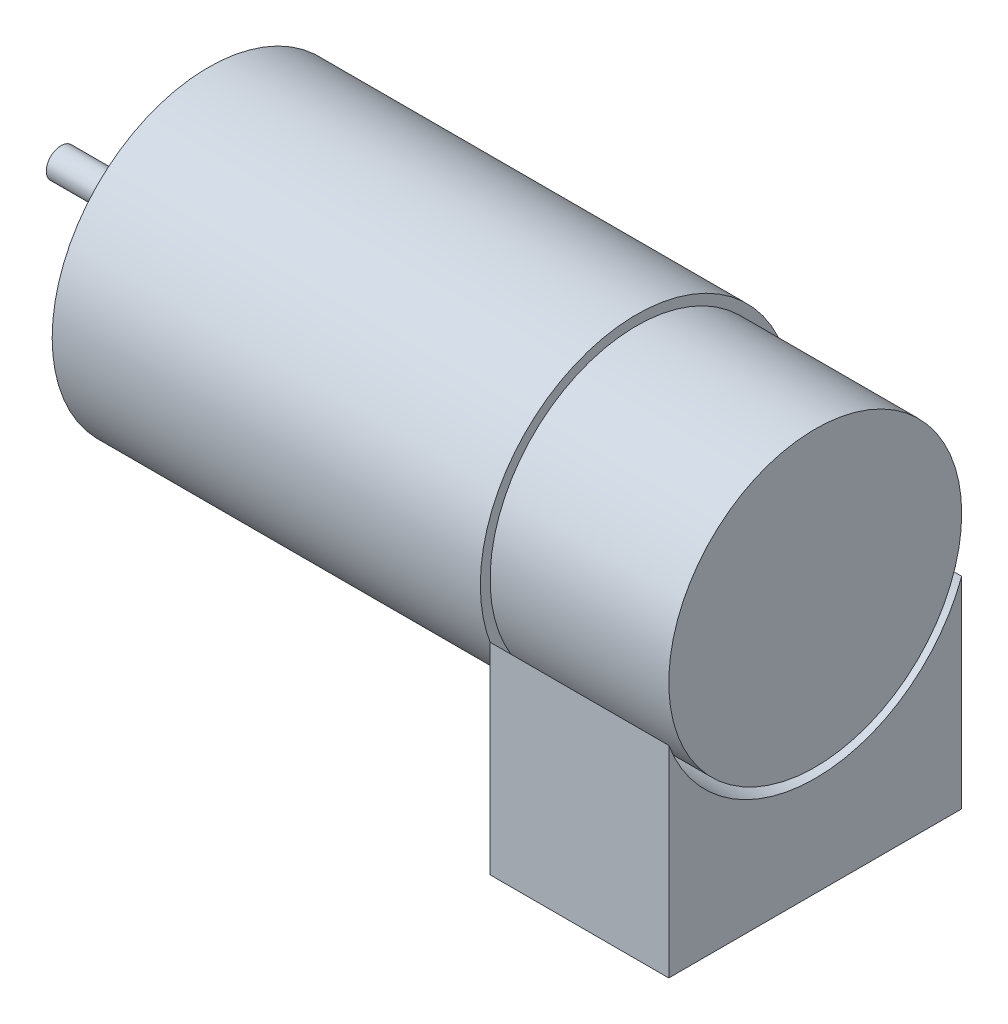
ISO-10303-21;
HEADER;
FILE_DESCRIPTION(('STEP AP214'),'2;1');
FILE_NAME('part.step','',(''),(''),'','','');
FILE_SCHEMA(('AUTOMOTIVE_DESIGN { 1 0 10303 214 1 1 1 1 }'));
ENDSEC;
DATA;
#1=APPLICATION_CONTEXT('core data for automotive mechanical design processes');
#2=APPLICATION_PROTOCOL_DEFINITION('international standard','automotive_design',2000,#1);
#3=PRODUCT_CONTEXT('',#1,'mechanical');
#4=PRODUCT('Part','Part','',(#3));
#5=PRODUCT_RELATED_PRODUCT_CATEGORY('part','',(#4));
#6=PRODUCT_DEFINITION_FORMATION('','',#4);
#7=PRODUCT_DEFINITION_CONTEXT('part definition',#1,'design');
#8=PRODUCT_DEFINITION('design','',#6,#7);
#9=PRODUCT_DEFINITION_SHAPE('','',#8);
#10=(LENGTH_UNIT() NAMED_UNIT(*) SI_UNIT(.MILLI.,.METRE.));
#11=(NAMED_UNIT(*) PLANE_ANGLE_UNIT() SI_UNIT($,.RADIAN.));
#12=(NAMED_UNIT(*) SI_UNIT($,.STERADIAN.) SOLID_ANGLE_UNIT());
#13=UNCERTAINTY_MEASURE_WITH_UNIT(LENGTH_MEASURE(1.E-05),#10,'distance_accuracy_value','');
#14=(GEOMETRIC_REPRESENTATION_CONTEXT(3) GLOBAL_UNCERTAINTY_ASSIGNED_CONTEXT((#13)) GLOBAL_UNIT_ASSIGNED_CONTEXT((#10,
#11,#12)) REPRESENTATION_CONTEXT('',''));
#15=CARTESIAN_POINT('',(0.,0.,0.));
#16=DIRECTION('',(0.,0.,1.));
#17=DIRECTION('',(1.,0.,0.));
#18=AXIS2_PLACEMENT_3D('',#15,#16,#17);
#19=CARTESIAN_POINT('',(77.25,-26.2,0.));
#20=DIRECTION('',(0.,1.,0.));
#21=DIRECTION('',(0.,0.,1.));
#22=AXIS2_PLACEMENT_3D('',#19,#20,#21);
#23=PLANE('',#22);
#24=DIRECTION('',(0.,0.,-1.));
#25=VECTOR('',#24,1.);
#26=CARTESIAN_POINT('',(58.95,-26.2,0.));
#27=LINE('',#26,#25);
#28=CARTESIAN_POINT('',(58.95,-26.2,15.));
#29=VERTEX_POINT('',#28);
#30=CARTESIAN_POINT('',(58.95,-26.2,-15.));
#31=VERTEX_POINT('',#30);
#32=EDGE_CURVE('E122',#29,#31,#27,.T.);
#33=ORIENTED_EDGE('',*,*,#32,.T.);
#34=DIRECTION('',(-1.,0.,0.));
#35=VECTOR('',#34,1.);
#36=CARTESIAN_POINT('',(77.25,-26.2,-15.));
#37=LINE('',#36,#35);
#38=CARTESIAN_POINT('',(77.25,-26.2,-15.));
#39=VERTEX_POINT('',#38);
#40=EDGE_CURVE('E13',#39,#31,#37,.T.);
#41=ORIENTED_EDGE('',*,*,#40,.F.);
#42=DIRECTION('',(0.,0.,-1.));
#43=VECTOR('',#42,1.);
#44=CARTESIAN_POINT('',(77.25,-26.2,0.));
#45=LINE('',#44,#43);
#46=CARTESIAN_POINT('',(77.25,-26.2,15.));
#47=VERTEX_POINT('',#46);
#48=EDGE_CURVE('E107',#47,#39,#45,.T.);
#49=ORIENTED_EDGE('',*,*,#48,.F.);
#50=DIRECTION('',(-1.,0.,0.));
#51=VECTOR('',#50,1.);
#52=CARTESIAN_POINT('',(77.25,-26.2,15.));
#53=LINE('',#52,#51);
#54=EDGE_CURVE('E118',#47,#29,#53,.T.);
#55=ORIENTED_EDGE('',*,*,#54,.T.);
#56=EDGE_LOOP('',(#33,#41,#49,#55));
#57=FACE_BOUND('',#56,.T.);
#58=ADVANCED_FACE('F60',(#57),#23,.F.);
#59=CARTESIAN_POINT('',(77.25,0.,-15.));
#60=DIRECTION('',(0.,0.,1.));
#61=DIRECTION('',(0.,-1.,0.));
#62=AXIS2_PLACEMENT_3D('',#59,#60,#61);
#63=PLANE('',#62);
#64=DIRECTION('',(0.,1.,0.));
#65=VECTOR('',#64,1.);
#66=CARTESIAN_POINT('',(58.95,0.,-15.));
#67=LINE('',#66,#65);
#68=CARTESIAN_POINT('',(58.95,-5.56776436283002,-15.));
#69=VERTEX_POINT('',#68);
#70=EDGE_CURVE('E112',#31,#69,#67,.T.);
#71=ORIENTED_EDGE('',*,*,#70,.T.);
#72=DIRECTION('',(-1.,0.,0.));
#73=VECTOR('',#72,1.);
#74=CARTESIAN_POINT('',(77.25,-5.56776436283002,-15.));
#75=LINE('',#74,#73);
#76=CARTESIAN_POINT('',(77.25,-5.56776436283002,-15.));
#77=VERTEX_POINT('',#76);
#78=EDGE_CURVE('E68',#77,#69,#75,.T.);
#79=ORIENTED_EDGE('',*,*,#78,.F.);
#80=DIRECTION('',(0.,1.,0.));
#81=VECTOR('',#80,1.);
#82=CARTESIAN_POINT('',(77.25,0.,-15.));
#83=LINE('',#82,#81);
#84=EDGE_CURVE('E102',#39,#77,#83,.T.);
#85=ORIENTED_EDGE('',*,*,#84,.F.);
#86=ORIENTED_EDGE('',*,*,#40,.T.);
#87=EDGE_LOOP('',(#71,#79,#85,#86));
#88=FACE_BOUND('',#87,.T.);
#89=ADVANCED_FACE('F111',(#88),#63,.F.);
#90=CARTESIAN_POINT('',(77.25,0.,0.));
#91=DIRECTION('',(-1.,0.,0.));
#92=DIRECTION('',(0.,0.,1.));
#93=AXIS2_PLACEMENT_3D('',#90,#91,#92);
#94=CYLINDRICAL_SURFACE('',#93,16.);
#95=CARTESIAN_POINT('',(58.95,0.,0.));
#96=DIRECTION('',(1.,0.,0.));
#97=DIRECTION('',(0.,0.,-1.));
#98=AXIS2_PLACEMENT_3D('',#95,#96,#97);
#99=CIRCLE('',#98,16.);
#100=CARTESIAN_POINT('',(58.95,-5.56776436283002,15.));
#101=VERTEX_POINT('',#100);
#102=EDGE_CURVE('E126',#101,#69,#99,.T.);
#103=ORIENTED_EDGE('',*,*,#102,.F.);
#104=DIRECTION('',(-1.,0.,0.));
#105=VECTOR('',#104,1.);
#106=CARTESIAN_POINT('',(77.25,-5.56776436283002,15.));
#107=LINE('',#106,#105);
#108=CARTESIAN_POINT('',(77.25,-5.56776436283002,15.));
#109=VERTEX_POINT('',#108);
#110=EDGE_CURVE('E92',#109,#101,#107,.T.);
#111=ORIENTED_EDGE('',*,*,#110,.F.);
#112=CARTESIAN_POINT('',(77.25,0.,0.));
#113=DIRECTION('',(1.,0.,0.));
#114=DIRECTION('',(0.,0.,-1.));
#115=AXIS2_PLACEMENT_3D('',#112,#113,#114);
#116=CIRCLE('',#115,16.);
#117=EDGE_CURVE('E105',#109,#77,#116,.T.);
#118=ORIENTED_EDGE('',*,*,#117,.T.);
#119=ORIENTED_EDGE('',*,*,#78,.T.);
#120=EDGE_LOOP('',(#103,#111,#118,#119));
#121=FACE_BOUND('',#120,.T.);
#122=ADVANCED_FACE('F116',(#121),#94,.F.);
#123=CARTESIAN_POINT('',(77.25,0.,15.));
#124=DIRECTION('',(0.,0.,-1.));
#125=DIRECTION('',(0.,1.,0.));
#126=AXIS2_PLACEMENT_3D('',#123,#124,#125);
#127=PLANE('',#126);
#128=DIRECTION('',(0.,-1.,0.));
#129=VECTOR('',#128,1.);
#130=CARTESIAN_POINT('',(58.95,0.,15.));
#131=LINE('',#130,#129);
#132=EDGE_CURVE('E95',#101,#29,#131,.T.);
#133=ORIENTED_EDGE('',*,*,#132,.T.);
#134=ORIENTED_EDGE('',*,*,#54,.F.);
#135=DIRECTION('',(0.,-1.,0.));
#136=VECTOR('',#135,1.);
#137=CARTESIAN_POINT('',(77.25,0.,15.));
#138=LINE('',#137,#136);
#139=EDGE_CURVE('E76',#109,#47,#138,.T.);
#140=ORIENTED_EDGE('',*,*,#139,.F.);
#141=ORIENTED_EDGE('',*,*,#110,.T.);
#142=EDGE_LOOP('',(#133,#134,#140,#141));
#143=FACE_BOUND('',#142,.T.);
#144=ADVANCED_FACE('F139',(#143),#127,.F.);
#145=CARTESIAN_POINT('',(77.25,0.,0.));
#146=DIRECTION('',(1.,0.,0.));
#147=DIRECTION('',(0.,0.,-1.));
#148=AXIS2_PLACEMENT_3D('',#145,#146,#147);
#149=PLANE('',#148);
#150=ORIENTED_EDGE('',*,*,#48,.T.);
#151=ORIENTED_EDGE('',*,*,#84,.T.);
#152=ORIENTED_EDGE('',*,*,#117,.F.);
#153=ORIENTED_EDGE('',*,*,#139,.T.);
#154=EDGE_LOOP('',(#150,#151,#152,#153));
#155=FACE_BOUND('',#154,.T.);
#156=ADVANCED_FACE('F103',(#155),#149,.T.);
#157=CARTESIAN_POINT('',(58.95,0.,0.));
#158=DIRECTION('',(1.,0.,0.));
#159=DIRECTION('',(0.,0.,-1.));
#160=AXIS2_PLACEMENT_3D('',#157,#158,#159);
#161=PLANE('',#160);
#162=ORIENTED_EDGE('',*,*,#32,.F.);
#163=ORIENTED_EDGE('',*,*,#132,.F.);
#164=ORIENTED_EDGE('',*,*,#102,.T.);
#165=ORIENTED_EDGE('',*,*,#70,.F.);
#166=EDGE_LOOP('',(#162,#163,#164,#165));
#167=FACE_BOUND('',#166,.T.);
#168=ADVANCED_FACE('F133',(#167),#161,.F.);
#169=CLOSED_SHELL('',(#58,#89,#122,#144,#156,#168));
#170=MANIFOLD_SOLID_BREP('B2',#169);
#171=CARTESIAN_POINT('',(0.,0.,0.));
#172=DIRECTION('',(-1.,0.,0.));
#173=DIRECTION('',(0.,0.,1.));
#174=AXIS2_PLACEMENT_3D('',#171,#172,#173);
#175=PLANE('',#174);
#176=CARTESIAN_POINT('',(0.,0.,0.));
#177=DIRECTION('',(-1.,0.,0.));
#178=DIRECTION('',(0.,0.,1.));
#179=AXIS2_PLACEMENT_3D('',#176,#177,#178);
#180=CIRCLE('',#179,1.5);
#181=CARTESIAN_POINT('',(0.,0.,1.5));
#182=VERTEX_POINT('',#181);
#183=EDGE_CURVE('E240',#182,#182,#180,.T.);
#184=ORIENTED_EDGE('',*,*,#183,.T.);
#185=EDGE_LOOP('',(#184));
#186=FACE_BOUND('',#185,.T.);
#187=ADVANCED_FACE('F184',(#186),#175,.T.);
#188=CARTESIAN_POINT('',(58.95,0.,0.));
#189=DIRECTION('',(1.,0.,0.));
#190=DIRECTION('',(0.,0.,-1.));
#191=AXIS2_PLACEMENT_3D('',#188,#189,#190);
#192=PLANE('',#191);
#193=CARTESIAN_POINT('',(58.95,0.,0.));
#194=DIRECTION('',(1.,0.,0.));
#195=DIRECTION('',(0.,0.,-1.));
#196=AXIS2_PLACEMENT_3D('',#193,#194,#195);
#197=CIRCLE('',#196,15.);
#198=CARTESIAN_POINT('',(58.95,0.,-15.));
#199=VERTEX_POINT('',#198);
#200=EDGE_CURVE('E58',#199,#199,#197,.T.);
#201=ORIENTED_EDGE('',*,*,#200,.F.);
#202=EDGE_LOOP('',(#201));
#203=FACE_BOUND('',#202,.T.);
#204=CARTESIAN_POINT('',(58.95,0.,0.));
#205=DIRECTION('',(-1.,0.,0.));
#206=DIRECTION('',(0.,0.,1.));
#207=AXIS2_PLACEMENT_3D('',#204,#205,#206);
#208=CIRCLE('',#207,16.);
#209=CARTESIAN_POINT('',(58.95,0.,16.));
#210=VERTEX_POINT('',#209);
#211=EDGE_CURVE('E187',#210,#210,#208,.T.);
#212=ORIENTED_EDGE('',*,*,#211,.F.);
#213=EDGE_LOOP('',(#212));
#214=FACE_BOUND('',#213,.T.);
#215=ADVANCED_FACE('F262',(#203,#214),#192,.T.);
#216=CARTESIAN_POINT('',(0.,0.,0.));
#217=DIRECTION('',(-1.,0.,0.));
#218=DIRECTION('',(0.,0.,1.));
#219=AXIS2_PLACEMENT_3D('',#216,#217,#218);
#220=CYLINDRICAL_SURFACE('',#219,16.);
#221=ORIENTED_EDGE('',*,*,#211,.T.);
#222=EDGE_LOOP('',(#221));
#223=FACE_BOUND('',#222,.T.);
#224=CARTESIAN_POINT('',(15.1,0.,0.));
#225=DIRECTION('',(-1.,0.,0.));
#226=DIRECTION('',(0.,0.,1.));
#227=AXIS2_PLACEMENT_3D('',#224,#225,#226);
#228=CIRCLE('',#227,16.);
#229=CARTESIAN_POINT('',(15.1,0.,16.));
#230=VERTEX_POINT('',#229);
#231=EDGE_CURVE('E252',#230,#230,#228,.T.);
#232=ORIENTED_EDGE('',*,*,#231,.F.);
#233=EDGE_LOOP('',(#232));
#234=FACE_BOUND('',#233,.T.);
#235=ADVANCED_FACE('F259',(#223,#234),#220,.T.);
#236=CARTESIAN_POINT('',(15.1,0.,0.));
#237=DIRECTION('',(1.,0.,0.));
#238=DIRECTION('',(0.,0.,-1.));
#239=AXIS2_PLACEMENT_3D('',#236,#237,#238);
#240=PLANE('',#239);
#241=CARTESIAN_POINT('',(15.1,8.5,0.));
#242=DIRECTION('',(-1.,0.,0.));
#243=DIRECTION('',(0.,0.,1.));
#244=AXIS2_PLACEMENT_3D('',#241,#242,#243);
#245=CIRCLE('',#244,0.79999999999999);
#246=CARTESIAN_POINT('',(15.1,8.5,0.79999999999999));
#247=VERTEX_POINT('',#246);
#248=EDGE_CURVE('E216',#247,#247,#245,.T.);
#249=ORIENTED_EDGE('',*,*,#248,.F.);
#250=EDGE_LOOP('',(#249));
#251=FACE_BOUND('',#250,.T.);
#252=CARTESIAN_POINT('',(15.1,-4.28717923156454,-7.33962493840399));
#253=DIRECTION('',(-1.,0.,0.));
#254=DIRECTION('',(0.,0.,1.));
#255=AXIS2_PLACEMENT_3D('',#252,#253,#254);
#256=CIRCLE('',#255,0.79999999999999);
#257=CARTESIAN_POINT('',(15.1,-4.28717923156454,-6.539624938404));
#258=VERTEX_POINT('',#257);
#259=EDGE_CURVE('E215',#258,#258,#256,.T.);
#260=ORIENTED_EDGE('',*,*,#259,.F.);
#261=EDGE_LOOP('',(#260));
#262=FACE_BOUND('',#261,.T.);
#263=CARTESIAN_POINT('',(15.1,-4.25000000000003,7.36121593216771));
#264=DIRECTION('',(-1.,0.,0.));
#265=DIRECTION('',(0.,0.,1.));
#266=AXIS2_PLACEMENT_3D('',#263,#264,#265);
#267=CIRCLE('',#266,0.79999999999999);
#268=CARTESIAN_POINT('',(15.1,-4.25000000000003,8.1612159321677));
#269=VERTEX_POINT('',#268);
#270=EDGE_CURVE('E226',#269,#269,#267,.T.);
#271=ORIENTED_EDGE('',*,*,#270,.F.);
#272=EDGE_LOOP('',(#271));
#273=FACE_BOUND('',#272,.T.);
#274=CARTESIAN_POINT('',(15.1,-8.49982441863378,0.0546338026956659));
#275=DIRECTION('',(-1.,0.,0.));
#276=DIRECTION('',(0.,0.,1.));
#277=AXIS2_PLACEMENT_3D('',#274,#275,#276);
#278=CIRCLE('',#277,0.79999999999999);
#279=CARTESIAN_POINT('',(15.1,-8.49982441863378,0.854633802695656));
#280=VERTEX_POINT('',#279);
#281=EDGE_CURVE('E232',#280,#280,#278,.T.);
#282=ORIENTED_EDGE('',*,*,#281,.F.);
#283=EDGE_LOOP('',(#282));
#284=FACE_BOUND('',#283,.T.);
#285=CARTESIAN_POINT('',(15.1,0.,0.));
#286=DIRECTION('',(-1.,0.,0.));
#287=DIRECTION('',(0.,0.,1.));
#288=AXIS2_PLACEMENT_3D('',#285,#286,#287);
#289=CIRCLE('',#288,5.);
#290=CARTESIAN_POINT('',(15.1,0.,5.));
#291=VERTEX_POINT('',#290);
#292=EDGE_CURVE('E250',#291,#291,#289,.T.);
#293=ORIENTED_EDGE('',*,*,#292,.F.);
#294=EDGE_LOOP('',(#293));
#295=FACE_BOUND('',#294,.T.);
#296=ORIENTED_EDGE('',*,*,#231,.T.);
#297=EDGE_LOOP('',(#296));
#298=FACE_BOUND('',#297,.T.);
#299=ADVANCED_FACE('F269',(#251,#262,#273,#284,#295,#298),#240,.F.);
#300=CARTESIAN_POINT('',(0.,0.,0.));
#301=DIRECTION('',(-1.,0.,0.));
#302=DIRECTION('',(0.,0.,1.));
#303=AXIS2_PLACEMENT_3D('',#300,#301,#302);
#304=CYLINDRICAL_SURFACE('',#303,5.);
#305=ORIENTED_EDGE('',*,*,#292,.T.);
#306=EDGE_LOOP('',(#305));
#307=FACE_BOUND('',#306,.T.);
#308=CARTESIAN_POINT('',(13.,0.,0.));
#309=DIRECTION('',(-1.,0.,0.));
#310=DIRECTION('',(0.,0.,1.));
#311=AXIS2_PLACEMENT_3D('',#308,#309,#310);
#312=CIRCLE('',#311,5.);
#313=CARTESIAN_POINT('',(13.,0.,5.));
#314=VERTEX_POINT('',#313);
#315=EDGE_CURVE('E247',#314,#314,#312,.T.);
#316=ORIENTED_EDGE('',*,*,#315,.F.);
#317=EDGE_LOOP('',(#316));
#318=FACE_BOUND('',#317,.T.);
#319=ADVANCED_FACE('F276',(#307,#318),#304,.T.);
#320=CARTESIAN_POINT('',(13.,0.,0.));
#321=DIRECTION('',(1.,0.,0.));
#322=DIRECTION('',(0.,0.,-1.));
#323=AXIS2_PLACEMENT_3D('',#320,#321,#322);
#324=PLANE('',#323);
#325=CARTESIAN_POINT('',(13.,0.,0.));
#326=DIRECTION('',(-1.,0.,0.));
#327=DIRECTION('',(0.,0.,1.));
#328=AXIS2_PLACEMENT_3D('',#325,#326,#327);
#329=CIRCLE('',#328,1.5);
#330=CARTESIAN_POINT('',(13.,0.,1.5));
#331=VERTEX_POINT('',#330);
#332=EDGE_CURVE('E244',#331,#331,#329,.T.);
#333=ORIENTED_EDGE('',*,*,#332,.F.);
#334=EDGE_LOOP('',(#333));
#335=FACE_BOUND('',#334,.T.);
#336=ORIENTED_EDGE('',*,*,#315,.T.);
#337=EDGE_LOOP('',(#336));
#338=FACE_BOUND('',#337,.T.);
#339=ADVANCED_FACE('F280',(#335,#338),#324,.F.);
#340=CARTESIAN_POINT('',(0.,0.,0.));
#341=DIRECTION('',(-1.,0.,0.));
#342=DIRECTION('',(0.,0.,1.));
#343=AXIS2_PLACEMENT_3D('',#340,#341,#342);
#344=CYLINDRICAL_SURFACE('',#343,1.5);
#345=ORIENTED_EDGE('',*,*,#332,.T.);
#346=EDGE_LOOP('',(#345));
#347=FACE_BOUND('',#346,.T.);
#348=ORIENTED_EDGE('',*,*,#183,.F.);
#349=EDGE_LOOP('',(#348));
#350=FACE_BOUND('',#349,.T.);
#351=ADVANCED_FACE('F284',(#347,#350),#344,.T.);
#352=CARTESIAN_POINT('',(77.25,0.,0.));
#353=DIRECTION('',(-1.,0.,0.));
#354=DIRECTION('',(0.,0.,1.));
#355=AXIS2_PLACEMENT_3D('',#352,#353,#354);
#356=CYLINDRICAL_SURFACE('',#355,15.);
#357=CARTESIAN_POINT('',(77.25,0.,0.));
#358=DIRECTION('',(1.,0.,0.));
#359=DIRECTION('',(0.,0.,-1.));
#360=AXIS2_PLACEMENT_3D('',#357,#358,#359);
#361=CIRCLE('',#360,15.);
#362=CARTESIAN_POINT('',(77.25,0.,-15.));
#363=VERTEX_POINT('',#362);
#364=EDGE_CURVE('E238',#363,#363,#361,.T.);
#365=ORIENTED_EDGE('',*,*,#364,.F.);
#366=EDGE_LOOP('',(#365));
#367=FACE_BOUND('',#366,.T.);
#368=ORIENTED_EDGE('',*,*,#200,.T.);
#369=EDGE_LOOP('',(#368));
#370=FACE_BOUND('',#369,.T.);
#371=ADVANCED_FACE('F288',(#367,#370),#356,.T.);
#372=CARTESIAN_POINT('',(77.25,0.,0.));
#373=DIRECTION('',(1.,0.,0.));
#374=DIRECTION('',(0.,0.,-1.));
#375=AXIS2_PLACEMENT_3D('',#372,#373,#374);
#376=PLANE('',#375);
#377=ORIENTED_EDGE('',*,*,#364,.T.);
#378=EDGE_LOOP('',(#377));
#379=FACE_BOUND('',#378,.T.);
#380=ADVANCED_FACE('F292',(#379),#376,.T.);
#381=CARTESIAN_POINT('',(18.219311504778,-8.49982441863378,0.0546338026956659));
#382=DIRECTION('',(-1.,0.,0.));
#383=DIRECTION('',(0.,0.,1.));
#384=AXIS2_PLACEMENT_3D('',#381,#382,#383);
#385=CONICAL_SURFACE('',#384,0.799999999999999,1.02974425867665);
#386=CARTESIAN_POINT('',(18.7,-8.49982441863378,0.0546338026956659));
#387=VERTEX_POINT('',#386);
#388=VERTEX_LOOP('',#387);
#389=FACE_BOUND('',#388,.T.);
#390=CARTESIAN_POINT('',(18.219311504778,-8.49982441863378,0.0546338026956659));
#391=DIRECTION('',(-1.,0.,0.));
#392=DIRECTION('',(0.,0.,1.));
#393=AXIS2_PLACEMENT_3D('',#390,#391,#392);
#394=CIRCLE('',#393,0.799999999999999);
#395=CARTESIAN_POINT('',(18.219311504778,-8.49982441863378,0.854633802695665));
#396=VERTEX_POINT('',#395);
#397=EDGE_CURVE('E235',#396,#396,#394,.T.);
#398=ORIENTED_EDGE('',*,*,#397,.T.);
#399=EDGE_LOOP('',(#398));
#400=FACE_BOUND('',#399,.T.);
#401=ADVANCED_FACE('F296',(#389,#400),#385,.F.);
#402=CARTESIAN_POINT('',(15.1,-8.49982441863378,0.0546338026956659));
#403=DIRECTION('',(-1.,0.,0.));
#404=DIRECTION('',(0.,0.,1.));
#405=AXIS2_PLACEMENT_3D('',#402,#403,#404);
#406=CYLINDRICAL_SURFACE('',#405,0.799999999999995);
#407=ORIENTED_EDGE('',*,*,#397,.F.);
#408=EDGE_LOOP('',(#407));
#409=FACE_BOUND('',#408,.T.);
#410=ORIENTED_EDGE('',*,*,#281,.T.);
#411=EDGE_LOOP('',(#410));
#412=FACE_BOUND('',#411,.T.);
#413=ADVANCED_FACE('F300',(#409,#412),#406,.F.);
#414=CARTESIAN_POINT('',(18.219311504778,-4.25000000000003,7.36121593216771));
#415=DIRECTION('',(-1.,0.,0.));
#416=DIRECTION('',(0.,0.,1.));
#417=AXIS2_PLACEMENT_3D('',#414,#415,#416);
#418=CONICAL_SURFACE('',#417,0.799999999999999,1.02974425867665);
#419=CARTESIAN_POINT('',(18.7,-4.25000000000004,7.36121593216771));
#420=VERTEX_POINT('',#419);
#421=VERTEX_LOOP('',#420);
#422=FACE_BOUND('',#421,.T.);
#423=CARTESIAN_POINT('',(18.219311504778,-4.25000000000003,7.36121593216771));
#424=DIRECTION('',(-1.,0.,0.));
#425=DIRECTION('',(0.,0.,1.));
#426=AXIS2_PLACEMENT_3D('',#423,#424,#425);
#427=CIRCLE('',#426,0.799999999999999);
#428=CARTESIAN_POINT('',(18.219311504778,-4.25000000000003,8.16121593216771));
#429=VERTEX_POINT('',#428);
#430=EDGE_CURVE('E229',#429,#429,#427,.T.);
#431=ORIENTED_EDGE('',*,*,#430,.T.);
#432=EDGE_LOOP('',(#431));
#433=FACE_BOUND('',#432,.T.);
#434=ADVANCED_FACE('F303',(#422,#433),#418,.F.);
#435=CARTESIAN_POINT('',(15.1,-4.25000000000003,7.36121593216771));
#436=DIRECTION('',(-1.,0.,0.));
#437=DIRECTION('',(0.,0.,1.));
#438=AXIS2_PLACEMENT_3D('',#435,#436,#437);
#439=CYLINDRICAL_SURFACE('',#438,0.799999999999995);
#440=ORIENTED_EDGE('',*,*,#430,.F.);
#441=EDGE_LOOP('',(#440));
#442=FACE_BOUND('',#441,.T.);
#443=ORIENTED_EDGE('',*,*,#270,.T.);
#444=EDGE_LOOP('',(#443));
#445=FACE_BOUND('',#444,.T.);
#446=ADVANCED_FACE('F307',(#442,#445),#439,.F.);
#447=CARTESIAN_POINT('',(18.219311504778,-4.28717923156454,-7.33962493840399));
#448=DIRECTION('',(-1.,0.,0.));
#449=DIRECTION('',(0.,0.,1.));
#450=AXIS2_PLACEMENT_3D('',#447,#448,#449);
#451=CONICAL_SURFACE('',#450,0.799999999999999,1.02974425867665);
#452=CARTESIAN_POINT('',(18.7,-4.28717923156454,-7.33962493840399));
#453=VERTEX_POINT('',#452);
#454=VERTEX_LOOP('',#453);
#455=FACE_BOUND('',#454,.T.);
#456=CARTESIAN_POINT('',(18.219311504778,-4.28717923156454,-7.33962493840399));
#457=DIRECTION('',(-1.,0.,0.));
#458=DIRECTION('',(0.,0.,1.));
#459=AXIS2_PLACEMENT_3D('',#456,#457,#458);
#460=CIRCLE('',#459,0.799999999999999);
#461=CARTESIAN_POINT('',(18.219311504778,-4.28717923156454,-6.53962493840399));
#462=VERTEX_POINT('',#461);
#463=EDGE_CURVE('E219',#462,#462,#460,.T.);
#464=ORIENTED_EDGE('',*,*,#463,.T.);
#465=EDGE_LOOP('',(#464));
#466=FACE_BOUND('',#465,.T.);
#467=ADVANCED_FACE('F310',(#455,#466),#451,.F.);
#468=CARTESIAN_POINT('',(15.1,-4.28717923156454,-7.33962493840399));
#469=DIRECTION('',(-1.,0.,0.));
#470=DIRECTION('',(0.,0.,1.));
#471=AXIS2_PLACEMENT_3D('',#468,#469,#470);
#472=CYLINDRICAL_SURFACE('',#471,0.799999999999995);
#473=ORIENTED_EDGE('',*,*,#463,.F.);
#474=EDGE_LOOP('',(#473));
#475=FACE_BOUND('',#474,.T.);
#476=ORIENTED_EDGE('',*,*,#259,.T.);
#477=EDGE_LOOP('',(#476));
#478=FACE_BOUND('',#477,.T.);
#479=ADVANCED_FACE('F209',(#475,#478),#472,.F.);
#480=CARTESIAN_POINT('',(18.219311504778,8.5,0.));
#481=DIRECTION('',(-1.,0.,0.));
#482=DIRECTION('',(0.,0.,1.));
#483=AXIS2_PLACEMENT_3D('',#480,#481,#482);
#484=CONICAL_SURFACE('',#483,0.799999999999999,1.02974425867665);
#485=CARTESIAN_POINT('',(18.7,8.5,0.));
#486=VERTEX_POINT('',#485);
#487=VERTEX_LOOP('',#486);
#488=FACE_BOUND('',#487,.T.);
#489=CARTESIAN_POINT('',(18.219311504778,8.5,0.));
#490=DIRECTION('',(-1.,0.,0.));
#491=DIRECTION('',(0.,0.,1.));
#492=AXIS2_PLACEMENT_3D('',#489,#490,#491);
#493=CIRCLE('',#492,0.799999999999999);
#494=CARTESIAN_POINT('',(18.219311504778,8.5,0.799999999999999));
#495=VERTEX_POINT('',#494);
#496=EDGE_CURVE('E213',#495,#495,#493,.T.);
#497=ORIENTED_EDGE('',*,*,#496,.T.);
#498=EDGE_LOOP('',(#497));
#499=FACE_BOUND('',#498,.T.);
#500=ADVANCED_FACE('F205',(#488,#499),#484,.F.);
#501=CARTESIAN_POINT('',(15.1,8.5,0.));
#502=DIRECTION('',(-1.,0.,0.));
#503=DIRECTION('',(0.,0.,1.));
#504=AXIS2_PLACEMENT_3D('',#501,#502,#503);
#505=CYLINDRICAL_SURFACE('',#504,0.799999999999994);
#506=ORIENTED_EDGE('',*,*,#496,.F.);
#507=EDGE_LOOP('',(#506));
#508=FACE_BOUND('',#507,.T.);
#509=ORIENTED_EDGE('',*,*,#248,.T.);
#510=EDGE_LOOP('',(#509));
#511=FACE_BOUND('',#510,.T.);
#512=ADVANCED_FACE('F208',(#508,#511),#505,.F.);
#513=CLOSED_SHELL('',(#187,#215,#235,#299,#319,#339,#351,#371,#380,#401,#413,#434,#446,#467,
#479,#500,#512));
#514=MANIFOLD_SOLID_BREP('B7',#513);
#515=ADVANCED_BREP_SHAPE_REPRESENTATION('',(#18,#170,#514),#14);
#516=SHAPE_DEFINITION_REPRESENTATION(#9,#515);
ENDSEC;
END-ISO-10303-21;
